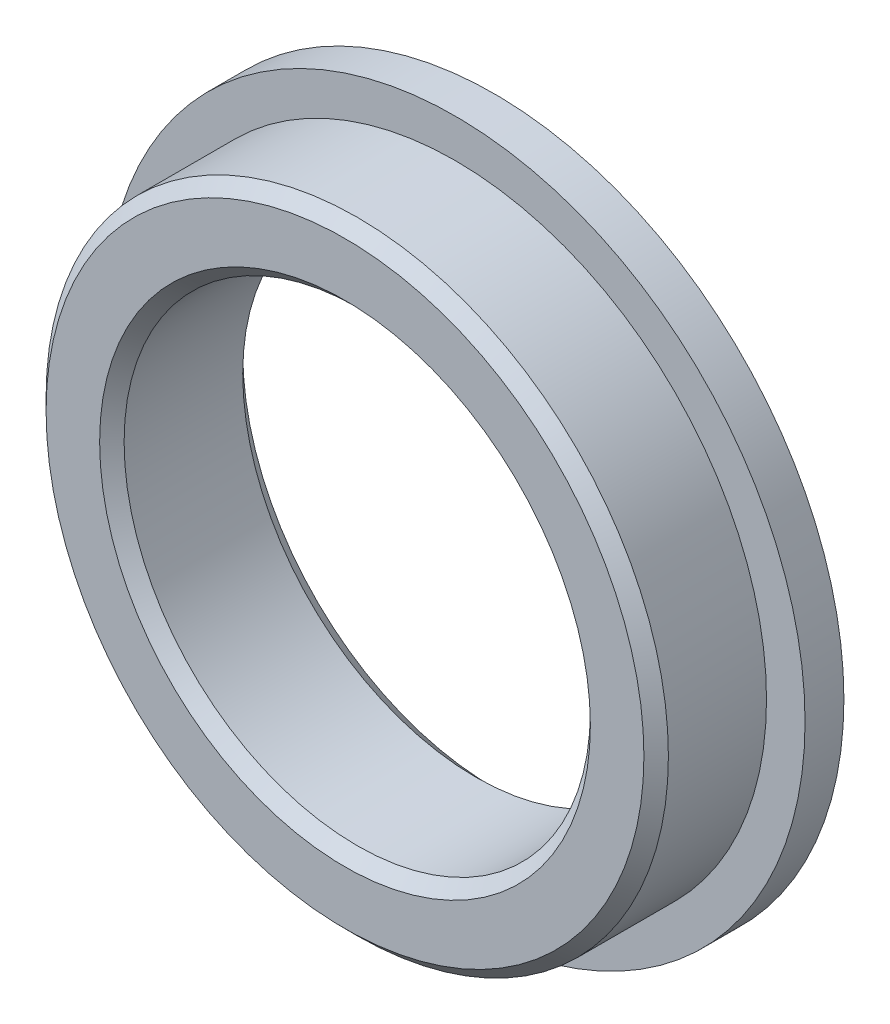
ISO-10303-21;
HEADER;
FILE_DESCRIPTION(('STEP AP214'),'2;1');
FILE_NAME('part.step','',(''),(''),'','','');
FILE_SCHEMA(('AUTOMOTIVE_DESIGN { 1 0 10303 214 1 1 1 1 }'));
ENDSEC;
DATA;
#1=APPLICATION_CONTEXT('core data for automotive mechanical design processes');
#2=APPLICATION_PROTOCOL_DEFINITION('international standard','automotive_design',2000,#1);
#3=PRODUCT_CONTEXT('',#1,'mechanical');
#4=PRODUCT('Part','Part','',(#3));
#5=PRODUCT_RELATED_PRODUCT_CATEGORY('part','',(#4));
#6=PRODUCT_DEFINITION_FORMATION('','',#4);
#7=PRODUCT_DEFINITION_CONTEXT('part definition',#1,'design');
#8=PRODUCT_DEFINITION('design','',#6,#7);
#9=PRODUCT_DEFINITION_SHAPE('','',#8);
#10=(LENGTH_UNIT() NAMED_UNIT(*) SI_UNIT(.MILLI.,.METRE.));
#11=(NAMED_UNIT(*) PLANE_ANGLE_UNIT() SI_UNIT($,.RADIAN.));
#12=(NAMED_UNIT(*) SI_UNIT($,.STERADIAN.) SOLID_ANGLE_UNIT());
#13=UNCERTAINTY_MEASURE_WITH_UNIT(LENGTH_MEASURE(1.E-05),#10,'distance_accuracy_value','');
#14=(GEOMETRIC_REPRESENTATION_CONTEXT(3) GLOBAL_UNCERTAINTY_ASSIGNED_CONTEXT((#13)) GLOBAL_UNIT_ASSIGNED_CONTEXT((#10,
#11,#12)) REPRESENTATION_CONTEXT('',''));
#15=CARTESIAN_POINT('',(0.,0.,0.));
#16=DIRECTION('',(0.,0.,1.));
#17=DIRECTION('',(1.,0.,0.));
#18=AXIS2_PLACEMENT_3D('',#15,#16,#17);
#19=CARTESIAN_POINT('',(0.,9.525,3.048));
#20=DIRECTION('',(0.,0.,-1.));
#21=DIRECTION('',(-1.,0.,0.));
#22=AXIS2_PLACEMENT_3D('',#19,#20,#21);
#23=PLANE('',#22);
#24=CARTESIAN_POINT('',(0.,0.,3.048));
#25=DIRECTION('',(0.,0.,-1.));
#26=DIRECTION('',(-1.,0.,0.));
#27=AXIS2_PLACEMENT_3D('',#24,#25,#26);
#28=CIRCLE('',#27,12.2127);
#29=CARTESIAN_POINT('',(-12.2127,0.,3.048));
#30=VERTEX_POINT('',#29);
#31=EDGE_CURVE('E17',#30,#30,#28,.T.);
#32=ORIENTED_EDGE('',*,*,#31,.F.);
#33=EDGE_LOOP('',(#32));
#34=FACE_BOUND('',#33,.T.);
#35=CARTESIAN_POINT('',(0.,0.,3.048));
#36=DIRECTION('',(0.,0.,1.));
#37=DIRECTION('',(1.,0.,0.));
#38=AXIS2_PLACEMENT_3D('',#35,#36,#37);
#39=CIRCLE('',#38,10.025);
#40=CARTESIAN_POINT('',(10.025,0.,3.048));
#41=VERTEX_POINT('',#40);
#42=EDGE_CURVE('E38',#41,#41,#39,.F.);
#43=ORIENTED_EDGE('',*,*,#42,.T.);
#44=EDGE_LOOP('',(#43));
#45=FACE_BOUND('',#44,.T.);
#46=ADVANCED_FACE('F14',(#34,#45),#23,.F.);
#47=CARTESIAN_POINT('',(0.,0.,2.548));
#48=DIRECTION('',(0.,0.,-1.));
#49=DIRECTION('',(-1.,0.,0.));
#50=AXIS2_PLACEMENT_3D('',#47,#48,#49);
#51=CONICAL_SURFACE('',#50,12.7127,0.785398163397447);
#52=CARTESIAN_POINT('',(0.,0.,2.548));
#53=DIRECTION('',(0.,0.,1.));
#54=DIRECTION('',(1.,0.,0.));
#55=AXIS2_PLACEMENT_3D('',#52,#53,#54);
#56=CIRCLE('',#55,12.7127);
#57=CARTESIAN_POINT('',(12.7127,0.,2.548));
#58=VERTEX_POINT('',#57);
#59=EDGE_CURVE('E29',#58,#58,#56,.F.);
#60=ORIENTED_EDGE('',*,*,#59,.F.);
#61=EDGE_LOOP('',(#60));
#62=FACE_BOUND('',#61,.T.);
#63=ORIENTED_EDGE('',*,*,#31,.T.);
#64=EDGE_LOOP('',(#63));
#65=FACE_BOUND('',#64,.T.);
#66=ADVANCED_FACE('F46',(#62,#65),#51,.T.);
#67=CARTESIAN_POINT('',(0.,0.,3.048));
#68=DIRECTION('',(0.,0.,1.));
#69=DIRECTION('',(1.,0.,0.));
#70=AXIS2_PLACEMENT_3D('',#67,#68,#69);
#71=CONICAL_SURFACE('',#70,10.025,0.785398163397446);
#72=ORIENTED_EDGE('',*,*,#42,.F.);
#73=EDGE_LOOP('',(#72));
#74=FACE_BOUND('',#73,.T.);
#75=CARTESIAN_POINT('',(0.,0.,2.54799999999999));
#76=DIRECTION('',(0.,0.,1.));
#77=DIRECTION('',(1.,0.,0.));
#78=AXIS2_PLACEMENT_3D('',#75,#76,#77);
#79=CIRCLE('',#78,9.525);
#80=CARTESIAN_POINT('',(9.525,0.,2.54799999999999));
#81=VERTEX_POINT('',#80);
#82=EDGE_CURVE('E37',#81,#81,#79,.F.);
#83=ORIENTED_EDGE('',*,*,#82,.T.);
#84=EDGE_LOOP('',(#83));
#85=FACE_BOUND('',#84,.T.);
#86=ADVANCED_FACE('F53',(#74,#85),#71,.F.);
#87=CARTESIAN_POINT('',(0.,0.,4.09575));
#88=DIRECTION('',(0.,0.,1.));
#89=DIRECTION('',(1.,0.,0.));
#90=AXIS2_PLACEMENT_3D('',#87,#88,#89);
#91=CYLINDRICAL_SURFACE('',#90,12.7127);
#92=ORIENTED_EDGE('',*,*,#59,.T.);
#93=EDGE_LOOP('',(#92));
#94=FACE_BOUND('',#93,.T.);
#95=CARTESIAN_POINT('',(0.,0.,-1.4605));
#96=DIRECTION('',(0.,0.,1.));
#97=DIRECTION('',(1.,0.,0.));
#98=AXIS2_PLACEMENT_3D('',#95,#96,#97);
#99=CIRCLE('',#98,12.7127);
#100=CARTESIAN_POINT('',(12.7127,0.,-1.4605));
#101=VERTEX_POINT('',#100);
#102=EDGE_CURVE('E35',#101,#101,#99,.T.);
#103=ORIENTED_EDGE('',*,*,#102,.T.);
#104=EDGE_LOOP('',(#103));
#105=FACE_BOUND('',#104,.T.);
#106=ADVANCED_FACE('F78',(#94,#105),#91,.T.);
#107=CARTESIAN_POINT('',(0.,0.,4.09575));
#108=DIRECTION('',(0.,0.,1.));
#109=DIRECTION('',(1.,0.,0.));
#110=AXIS2_PLACEMENT_3D('',#107,#108,#109);
#111=CYLINDRICAL_SURFACE('',#110,9.525);
#112=ORIENTED_EDGE('',*,*,#82,.F.);
#113=EDGE_LOOP('',(#112));
#114=FACE_BOUND('',#113,.T.);
#115=CARTESIAN_POINT('',(0.,0.,-2.298));
#116=DIRECTION('',(0.,0.,-1.));
#117=DIRECTION('',(-1.,0.,0.));
#118=AXIS2_PLACEMENT_3D('',#115,#116,#117);
#119=CIRCLE('',#118,9.525);
#120=CARTESIAN_POINT('',(-9.525,0.,-2.298));
#121=VERTEX_POINT('',#120);
#122=EDGE_CURVE('E34',#121,#121,#119,.T.);
#123=ORIENTED_EDGE('',*,*,#122,.T.);
#124=EDGE_LOOP('',(#123));
#125=FACE_BOUND('',#124,.T.);
#126=ADVANCED_FACE('F74',(#114,#125),#111,.F.);
#127=CARTESIAN_POINT('',(0.,12.7127,-1.4605));
#128=DIRECTION('',(0.,0.,-1.));
#129=DIRECTION('',(-1.,0.,0.));
#130=AXIS2_PLACEMENT_3D('',#127,#128,#129);
#131=PLANE('',#130);
#132=CARTESIAN_POINT('',(0.,0.,-1.4605));
#133=DIRECTION('',(0.,0.,1.));
#134=DIRECTION('',(1.,0.,0.));
#135=AXIS2_PLACEMENT_3D('',#132,#133,#134);
#136=CIRCLE('',#135,14.2875);
#137=CARTESIAN_POINT('',(14.2875,0.,-1.4605));
#138=VERTEX_POINT('',#137);
#139=EDGE_CURVE('E26',#138,#138,#136,.F.);
#140=ORIENTED_EDGE('',*,*,#139,.F.);
#141=EDGE_LOOP('',(#140));
#142=FACE_BOUND('',#141,.T.);
#143=ORIENTED_EDGE('',*,*,#102,.F.);
#144=EDGE_LOOP('',(#143));
#145=FACE_BOUND('',#144,.T.);
#146=ADVANCED_FACE('F70',(#142,#145),#131,.F.);
#147=CARTESIAN_POINT('',(0.,0.,-3.048));
#148=DIRECTION('',(0.,0.,-1.));
#149=DIRECTION('',(-1.,0.,0.));
#150=AXIS2_PLACEMENT_3D('',#147,#148,#149);
#151=CONICAL_SURFACE('',#150,10.275,0.785398163397446);
#152=CARTESIAN_POINT('',(0.,0.,-3.048));
#153=DIRECTION('',(0.,0.,-1.));
#154=DIRECTION('',(-1.,0.,0.));
#155=AXIS2_PLACEMENT_3D('',#152,#153,#154);
#156=CIRCLE('',#155,10.275);
#157=CARTESIAN_POINT('',(-10.275,0.,-3.048));
#158=VERTEX_POINT('',#157);
#159=EDGE_CURVE('E21',#158,#158,#156,.T.);
#160=ORIENTED_EDGE('',*,*,#159,.T.);
#161=EDGE_LOOP('',(#160));
#162=FACE_BOUND('',#161,.T.);
#163=ORIENTED_EDGE('',*,*,#122,.F.);
#164=EDGE_LOOP('',(#163));
#165=FACE_BOUND('',#164,.T.);
#166=ADVANCED_FACE('F63',(#162,#165),#151,.F.);
#167=CARTESIAN_POINT('',(0.,0.,4.09575));
#168=DIRECTION('',(0.,0.,1.));
#169=DIRECTION('',(1.,0.,0.));
#170=AXIS2_PLACEMENT_3D('',#167,#168,#169);
#171=CYLINDRICAL_SURFACE('',#170,14.2875);
#172=ORIENTED_EDGE('',*,*,#139,.T.);
#173=EDGE_LOOP('',(#172));
#174=FACE_BOUND('',#173,.T.);
#175=CARTESIAN_POINT('',(0.,0.,-3.048));
#176=DIRECTION('',(0.,0.,1.));
#177=DIRECTION('',(1.,0.,0.));
#178=AXIS2_PLACEMENT_3D('',#175,#176,#177);
#179=CIRCLE('',#178,14.2875);
#180=CARTESIAN_POINT('',(14.2875,0.,-3.048));
#181=VERTEX_POINT('',#180);
#182=EDGE_CURVE('E10',#181,#181,#179,.T.);
#183=ORIENTED_EDGE('',*,*,#182,.T.);
#184=EDGE_LOOP('',(#183));
#185=FACE_BOUND('',#184,.T.);
#186=ADVANCED_FACE('F57',(#174,#185),#171,.T.);
#187=CARTESIAN_POINT('',(0.,14.2875,-3.048));
#188=DIRECTION('',(0.,0.,1.));
#189=DIRECTION('',(1.,0.,0.));
#190=AXIS2_PLACEMENT_3D('',#187,#188,#189);
#191=PLANE('',#190);
#192=ORIENTED_EDGE('',*,*,#182,.F.);
#193=EDGE_LOOP('',(#192));
#194=FACE_BOUND('',#193,.T.);
#195=ORIENTED_EDGE('',*,*,#159,.F.);
#196=EDGE_LOOP('',(#195));
#197=FACE_BOUND('',#196,.T.);
#198=ADVANCED_FACE('F55',(#194,#197),#191,.F.);
#199=CLOSED_SHELL('',(#46,#66,#86,#106,#126,#146,#166,#186,#198));
#200=MANIFOLD_SOLID_BREP('B1',#199);
#201=ADVANCED_BREP_SHAPE_REPRESENTATION('',(#18,#200),#14);
#202=SHAPE_DEFINITION_REPRESENTATION(#9,#201);
ENDSEC;
END-ISO-10303-21;
